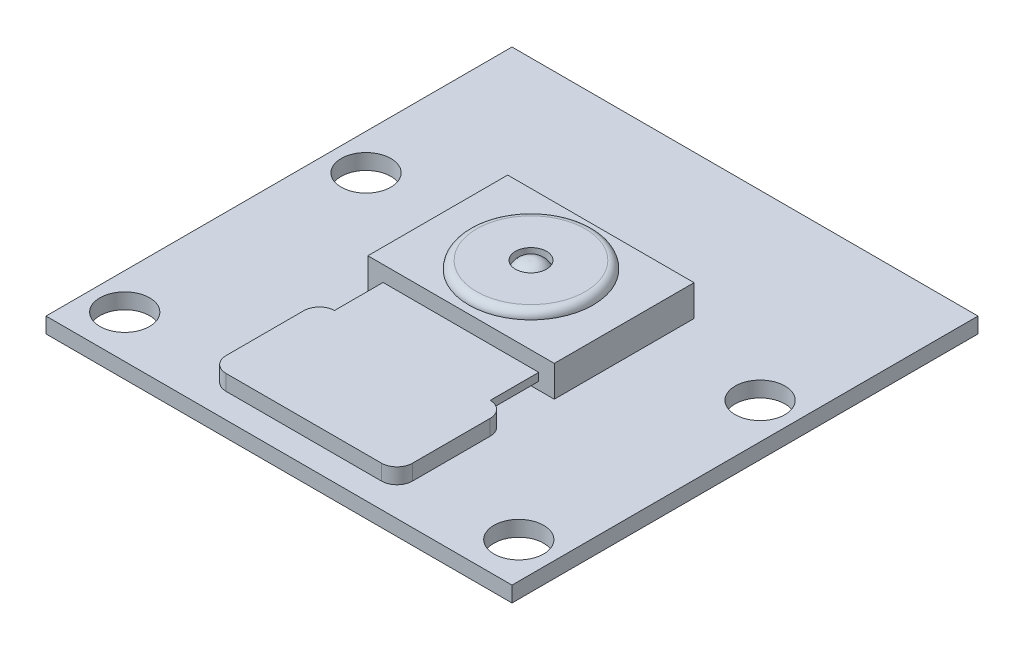
ISO-10303-21;
HEADER;
FILE_DESCRIPTION(('STEP AP214'),'2;1');
FILE_NAME('part.step','',(''),(''),'','','');
FILE_SCHEMA(('AUTOMOTIVE_DESIGN { 1 0 10303 214 1 1 1 1 }'));
ENDSEC;
DATA;
#1=APPLICATION_CONTEXT('core data for automotive mechanical design processes');
#2=APPLICATION_PROTOCOL_DEFINITION('international standard','automotive_design',2000,#1);
#3=PRODUCT_CONTEXT('',#1,'mechanical');
#4=PRODUCT('Part','Part','',(#3));
#5=PRODUCT_RELATED_PRODUCT_CATEGORY('part','',(#4));
#6=PRODUCT_DEFINITION_FORMATION('','',#4);
#7=PRODUCT_DEFINITION_CONTEXT('part definition',#1,'design');
#8=PRODUCT_DEFINITION('design','',#6,#7);
#9=PRODUCT_DEFINITION_SHAPE('','',#8);
#10=(LENGTH_UNIT() NAMED_UNIT(*) SI_UNIT(.MILLI.,.METRE.));
#11=(NAMED_UNIT(*) PLANE_ANGLE_UNIT() SI_UNIT($,.RADIAN.));
#12=(NAMED_UNIT(*) SI_UNIT($,.STERADIAN.) SOLID_ANGLE_UNIT());
#13=UNCERTAINTY_MEASURE_WITH_UNIT(LENGTH_MEASURE(1.E-05),#10,'distance_accuracy_value','');
#14=(GEOMETRIC_REPRESENTATION_CONTEXT(3) GLOBAL_UNCERTAINTY_ASSIGNED_CONTEXT((#13)) GLOBAL_UNIT_ASSIGNED_CONTEXT((#10,
#11,#12)) REPRESENTATION_CONTEXT('',''));
#15=CARTESIAN_POINT('',(0.,0.,0.));
#16=DIRECTION('',(0.,0.,1.));
#17=DIRECTION('',(1.,0.,0.));
#18=AXIS2_PLACEMENT_3D('',#15,#16,#17);
#19=CARTESIAN_POINT('',(0.,3.,-1.22148048115364));
#20=DIRECTION('',(0.,1.,0.));
#21=DIRECTION('',(0.,0.,1.));
#22=AXIS2_PLACEMENT_3D('',#19,#20,#21);
#23=CYLINDRICAL_SURFACE('',#22,1.);
#24=CARTESIAN_POINT('',(0.,3.5,-1.22148048115364));
#25=DIRECTION('',(0.,1.,0.));
#26=DIRECTION('',(0.,0.,1.));
#27=AXIS2_PLACEMENT_3D('',#24,#25,#26);
#28=CIRCLE('',#27,1.);
#29=CARTESIAN_POINT('',(0.,3.5,-0.22148048115364));
#30=VERTEX_POINT('',#29);
#31=EDGE_CURVE('E193',#30,#30,#28,.T.);
#32=ORIENTED_EDGE('',*,*,#31,.T.);
#33=EDGE_LOOP('',(#32));
#34=FACE_BOUND('',#33,.T.);
#35=CARTESIAN_POINT('',(-0.554371974124098,3.00000000000003,-0.389211465566896));
#36=CARTESIAN_POINT('',(-0.544178906791887,3.00006650200129,-0.382421761626189));
#37=CARTESIAN_POINT('',(-0.533861040277246,3.00013092551154,-0.375819406120854));
#38=CARTESIAN_POINT('',(-0.512990772387658,3.00025560987221,-0.362998483615611));
#39=CARTESIAN_POINT('',(-0.502438391617316,3.00031587108642,-0.356779883078594));
#40=CARTESIAN_POINT('',(-0.481113241094692,3.00043223206213,-0.344734862959651));
#41=CARTESIAN_POINT('',(-0.470340489424373,3.00048833216333,-0.338908411367928));
#42=CARTESIAN_POINT('',(-0.448589119870472,3.00059637204323,-0.327655419409491));
#43=CARTESIAN_POINT('',(-0.437610517679698,3.00064831213749,-0.322228848712495));
#44=CARTESIAN_POINT('',(-0.415462218032627,3.00074803305151,-0.311782852182568));
#45=CARTESIAN_POINT('',(-0.40429253402966,3.00079581416265,-0.306763397827846));
#46=CARTESIAN_POINT('',(-0.381777099702852,3.00088721807743,-0.297138314521682));
#47=CARTESIAN_POINT('',(-0.370431360746799,3.00093084114825,-0.292532658980756));
#48=CARTESIAN_POINT('',(-0.347579075743062,3.00101392986784,-0.283741304650766));
#49=CARTESIAN_POINT('',(-0.336072539138216,3.00105339575958,-0.279555581318283));
#50=CARTESIAN_POINT('',(-0.312914130309498,3.00112817092488,-0.271609662206429));
#51=CARTESIAN_POINT('',(-0.301262265769572,3.00116348041718,-0.267849444034258));
#52=CARTESIAN_POINT('',(-0.277828863803228,3.00122994350577,-0.260759539153688));
#53=CARTESIAN_POINT('',(-0.266047332473069,3.00126109729654,-0.257429832297918));
#54=CARTESIAN_POINT('',(-0.242370430405634,3.0013192496224,-0.251205380318952));
#55=CARTESIAN_POINT('',(-0.230475064352731,3.0013462483277,-0.248310617378707));
#56=CARTESIAN_POINT('',(-0.206586476142561,3.00139609104101,-0.242959904161619));
#57=CARTESIAN_POINT('',(-0.194593257437673,3.00141893519495,-0.240503938472795));
#58=CARTESIAN_POINT('',(-0.170525075985715,3.00146046928194,-0.236034086327824));
#59=CARTESIAN_POINT('',(-0.158450115642488,3.00147915933661,-0.234020186929186));
#60=CARTESIAN_POINT('',(-0.134234670492959,3.00151238561936,-0.230437145332013));
#61=CARTESIAN_POINT('',(-0.122094187228451,3.00152692194475,-0.228867992714411));
#62=CARTESIAN_POINT('',(-0.0977640019560296,3.00155184108108,-0.22617653056521));
#63=CARTESIAN_POINT('',(-0.0855743008168355,3.00156222396501,-0.225054213181276));
#64=CARTESIAN_POINT('',(-0.061162050167797,3.00157883644838,-0.223257912596593));
#65=CARTESIAN_POINT('',(-0.0489395010445144,3.00158506609648,-0.222583924142813));
#66=CARTESIAN_POINT('',(-0.0244779678833573,3.0015933722559,-0.221685175793561));
#67=CARTESIAN_POINT('',(-0.0122389839421929,3.00159544879156,-0.221460413266127));
#68=CARTESIAN_POINT('',(0.012238983940139,3.00159544879156,-0.221460413266101));
#69=CARTESIAN_POINT('',(0.0244779678813066,3.0015933722559,-0.221685175793511));
#70=CARTESIAN_POINT('',(0.0489395010424763,3.00158506609647,-0.222583924142712));
#71=CARTESIAN_POINT('',(0.0611620501657684,3.00157883644837,-0.223257912596466));
#72=CARTESIAN_POINT('',(0.0855743008148321,3.001562223965,-0.225054213181101));
#73=CARTESIAN_POINT('',(0.0977640019540418,3.00155184108107,-0.226176530565013));
#74=CARTESIAN_POINT('',(0.122094187226501,3.00152692194474,-0.228867992714168));
#75=CARTESIAN_POINT('',(0.134234670491031,3.00151238561936,-0.230437145331749));
#76=CARTESIAN_POINT('',(0.158450115640609,3.00147915933661,-0.23402018692888));
#77=CARTESIAN_POINT('',(0.170525075983864,3.00146046928194,-0.236034086327499));
#78=CARTESIAN_POINT('',(0.194593257435883,3.00141893519495,-0.240503938472434));
#79=CARTESIAN_POINT('',(0.206586476140804,3.00139609104101,-0.242959904161242));
#80=CARTESIAN_POINT('',(0.230475064351047,3.00134624832769,-0.248310617378302));
#81=CARTESIAN_POINT('',(0.242370430403988,3.00131924962239,-0.251205380318534));
#82=CARTESIAN_POINT('',(0.266047332471506,3.00126109729653,-0.257429832297479));
#83=CARTESIAN_POINT('',(0.27782886380171,3.00122994350576,-0.260759539153242));
#84=CARTESIAN_POINT('',(0.301262265768147,3.00116348041717,-0.2678494440338));
#85=CARTESIAN_POINT('',(0.312914130308122,3.00112817092487,-0.271609662205967));
#86=CARTESIAN_POINT('',(0.336072539136943,3.00105339575956,-0.279555581317819));
#87=CARTESIAN_POINT('',(0.347579075741842,3.00101392986782,-0.283741304650305));
#88=CARTESIAN_POINT('',(0.370431360745691,3.00093084114823,-0.292532658980304));
#89=CARTESIAN_POINT('',(0.381777099701801,3.00088721807741,-0.297138314521238));
#90=CARTESIAN_POINT('',(0.404292534028729,3.00079581416264,-0.306763397827423));
#91=CARTESIAN_POINT('',(0.415462218031757,3.00074803305149,-0.31178285218216));
#92=CARTESIAN_POINT('',(0.437610517678954,3.00064831213747,-0.322228848712122));
#93=CARTESIAN_POINT('',(0.448589119869793,3.00059637204321,-0.327655419409138));
#94=CARTESIAN_POINT('',(0.470340489423826,3.00048833216331,-0.338908411367624));
#95=CARTESIAN_POINT('',(0.481113241094211,3.00043223206211,-0.344734862959375));
#96=CARTESIAN_POINT('',(0.502438391616971,3.00031587108639,-0.356779883078382));
#97=CARTESIAN_POINT('',(0.512990772387384,3.00025560987218,-0.362998483615434));
#98=CARTESIAN_POINT('',(0.533861040277112,3.00013092551152,-0.375819406120757));
#99=CARTESIAN_POINT('',(0.544178906791824,3.00006650200127,-0.382421761626134));
#100=CARTESIAN_POINT('',(0.554371974124104,3.,-0.389211465566888));
#101=B_SPLINE_CURVE_WITH_KNOTS('',3,(#35,#36,#37,#38,#39,#40,#41,#42,#43,#44,#45,#46,#47,#48,
#49,#50,#51,#52,#53,#54,#55,#56,#57,#58,#59,#60,#61,#62,#63,#64,#65,#66,#67,#68,#69,#70,#71,#72,
#73,#74,#75,#76,#77,#78,#79,#80,#81,#82,#83,#84,#85,#86,#87,#88,#89,#90,#91,#92,#93,#94,#95,#96,
#97,#98,#99,#100),.UNSPECIFIED.,.F.,.F.,(4,2,2,2,2,2,2,2,2,2,2,2,2,2,2,2,2,2,2,2,2,2,2,2,2,2,2,
2,2,2,2,2,4),(0.,0.0367406541053907,0.0734780928117864,0.110212529118852,0.146944176307782,
0.183673247921162,0.220399957742831,0.257124519777746,0.293847148231868,0.330568057492038,
0.367287462105868,0.404005576761635,0.440722616268177,0.477438795534791,0.514154329551147,
0.550869433367182,0.587584322073016,0.624299210778857,0.661014314594917,0.697729848611313,
0.734446027877984,0.771163067384598,0.807881182040453,0.844600586654388,0.881321495914679,
0.918044124368938,0.954768686404006,0.991495396225844,1.02822446783941,1.06495611502854,
1.10169055133582,1.13842799004245,1.17516864414809),.UNSPECIFIED.);
#102=CARTESIAN_POINT('',(-0.554371974124105,3.,-0.389211465566887));
#103=VERTEX_POINT('',#102);
#104=CARTESIAN_POINT('',(0.554371974124105,3.,-0.389211465566887));
#105=VERTEX_POINT('',#104);
#106=EDGE_CURVE('E55',#103,#105,#101,.T.);
#107=ORIENTED_EDGE('',*,*,#106,.F.);
#108=CARTESIAN_POINT('',(0.,3.,-1.22148048115364));
#109=DIRECTION('',(0.,1.,0.));
#110=DIRECTION('',(0.,0.,1.));
#111=AXIS2_PLACEMENT_3D('',#108,#109,#110);
#112=CIRCLE('',#111,1.);
#113=EDGE_CURVE('E43',#105,#103,#112,.T.);
#114=ORIENTED_EDGE('',*,*,#113,.F.);
#115=EDGE_LOOP('',(#107,#114));
#116=FACE_BOUND('',#115,.T.);
#117=ADVANCED_FACE('F39',(#34,#116),#23,.F.);
#118=CARTESIAN_POINT('',(0.,3.,-1.22148048115364));
#119=DIRECTION('',(0.,1.,0.));
#120=DIRECTION('',(0.,0.,1.));
#121=AXIS2_PLACEMENT_3D('',#118,#119,#120);
#122=PLANE('',#121);
#123=ORIENTED_EDGE('',*,*,#113,.T.);
#124=CARTESIAN_POINT('',(0.,3.,-1.21704200870454));
#125=DIRECTION('',(0.,1.,0.));
#126=DIRECTION('',(0.,0.,1.));
#127=AXIS2_PLACEMENT_3D('',#124,#125,#126);
#128=CIRCLE('',#127,0.996309035312757);
#129=EDGE_CURVE('E11',#103,#105,#128,.F.);
#130=ORIENTED_EDGE('',*,*,#129,.T.);
#131=EDGE_LOOP('',(#123,#130));
#132=FACE_BOUND('',#131,.T.);
#133=ADVANCED_FACE('F196',(#132),#122,.T.);
#134=CARTESIAN_POINT('',(0.,3.,0.));
#135=DIRECTION('',(0.,-1.,0.));
#136=DIRECTION('',(0.,0.,-1.));
#137=AXIS2_PLACEMENT_3D('',#134,#135,#136);
#138=PLANE('',#137);
#139=DIRECTION('',(0.,0.,-1.));
#140=VECTOR('',#139,1.);
#141=CARTESIAN_POINT('',(6.,3.,3.27851951884636));
#142=LINE('',#141,#140);
#143=CARTESIAN_POINT('',(6.,3.,3.27851951884636));
#144=VERTEX_POINT('',#143);
#145=CARTESIAN_POINT('',(6.,3.,-5.72148048115364));
#146=VERTEX_POINT('',#145);
#147=EDGE_CURVE('E223',#144,#146,#142,.T.);
#148=ORIENTED_EDGE('',*,*,#147,.T.);
#149=DIRECTION('',(-1.,0.,0.));
#150=VECTOR('',#149,1.);
#151=CARTESIAN_POINT('',(-6.,3.,-5.72148048115364));
#152=LINE('',#151,#150);
#153=CARTESIAN_POINT('',(-6.,3.,-5.72148048115364));
#154=VERTEX_POINT('',#153);
#155=EDGE_CURVE('E226',#146,#154,#152,.T.);
#156=ORIENTED_EDGE('',*,*,#155,.T.);
#157=DIRECTION('',(0.,0.,1.));
#158=VECTOR('',#157,1.);
#159=CARTESIAN_POINT('',(-6.,3.,3.27851951884636));
#160=LINE('',#159,#158);
#161=CARTESIAN_POINT('',(-6.,3.,3.27851951884636));
#162=VERTEX_POINT('',#161);
#163=EDGE_CURVE('E229',#154,#162,#160,.T.);
#164=ORIENTED_EDGE('',*,*,#163,.T.);
#165=DIRECTION('',(1.,0.,0.));
#166=VECTOR('',#165,1.);
#167=CARTESIAN_POINT('',(-6.,3.,3.27851951884636));
#168=LINE('',#167,#166);
#169=EDGE_CURVE('E231',#162,#144,#168,.T.);
#170=ORIENTED_EDGE('',*,*,#169,.T.);
#171=EDGE_LOOP('',(#148,#156,#164,#170));
#172=FACE_BOUND('',#171,.T.);
#173=CARTESIAN_POINT('',(0.,3.,-1.22148048115364));
#174=DIRECTION('',(0.,-1.,0.));
#175=DIRECTION('',(0.,0.,-1.));
#176=AXIS2_PLACEMENT_3D('',#173,#174,#175);
#177=CIRCLE('',#176,4.);
#178=CARTESIAN_POINT('',(0.,3.,-5.22148048115364));
#179=VERTEX_POINT('',#178);
#180=EDGE_CURVE('E384',#179,#179,#177,.F.);
#181=ORIENTED_EDGE('',*,*,#180,.F.);
#182=EDGE_LOOP('',(#181));
#183=FACE_BOUND('',#182,.T.);
#184=ADVANCED_FACE('F404',(#172,#183),#138,.F.);
#185=CARTESIAN_POINT('',(-4.99999999999999,2.,6.40352104947633));
#186=DIRECTION('',(0.,0.,1.));
#187=DIRECTION('',(1.,0.,0.));
#188=AXIS2_PLACEMENT_3D('',#185,#186,#187);
#189=PLANE('',#188);
#190=DIRECTION('',(-1.,0.,0.));
#191=VECTOR('',#190,1.);
#192=CARTESIAN_POINT('',(4.99999999999999,1.5,6.40352104947633));
#193=LINE('',#192,#191);
#194=CARTESIAN_POINT('',(4.99999999999999,1.5,6.40352104947633));
#195=VERTEX_POINT('',#194);
#196=CARTESIAN_POINT('',(-5.,1.5,6.40352104947633));
#197=VERTEX_POINT('',#196);
#198=EDGE_CURVE('E207',#195,#197,#193,.T.);
#199=ORIENTED_EDGE('',*,*,#198,.F.);
#200=DIRECTION('',(0.,-1.,0.));
#201=VECTOR('',#200,1.);
#202=CARTESIAN_POINT('',(4.99999999999999,2.,6.40352104947633));
#203=LINE('',#202,#201);
#204=CARTESIAN_POINT('',(4.99999999999999,1.,6.40352104947633));
#205=VERTEX_POINT('',#204);
#206=EDGE_CURVE('E311',#195,#205,#203,.T.);
#207=ORIENTED_EDGE('',*,*,#206,.T.);
#208=DIRECTION('',(-1.,0.,0.));
#209=VECTOR('',#208,1.);
#210=CARTESIAN_POINT('',(-4.99999999999999,1.,6.40352104947633));
#211=LINE('',#210,#209);
#212=CARTESIAN_POINT('',(-5.,1.,6.40352104947633));
#213=VERTEX_POINT('',#212);
#214=EDGE_CURVE('E282',#205,#213,#211,.T.);
#215=ORIENTED_EDGE('',*,*,#214,.T.);
#216=DIRECTION('',(0.,-1.,0.));
#217=VECTOR('',#216,1.);
#218=CARTESIAN_POINT('',(-4.99999999999999,2.,6.40352104947633));
#219=LINE('',#218,#217);
#220=EDGE_CURVE('E307',#197,#213,#219,.T.);
#221=ORIENTED_EDGE('',*,*,#220,.F.);
#222=EDGE_LOOP('',(#199,#207,#215,#221));
#223=FACE_BOUND('',#222,.T.);
#224=ADVANCED_FACE('F443',(#223),#189,.F.);
#225=CARTESIAN_POINT('',(-6.,3.,3.27851951884636));
#226=DIRECTION('',(0.,0.,-1.));
#227=DIRECTION('',(-1.,0.,0.));
#228=AXIS2_PLACEMENT_3D('',#225,#226,#227);
#229=PLANE('',#228);
#230=DIRECTION('',(1.,0.,0.));
#231=VECTOR('',#230,1.);
#232=CARTESIAN_POINT('',(-6.,1.,3.27851951884636));
#233=LINE('',#232,#231);
#234=CARTESIAN_POINT('',(-6.,1.,3.27851951884636));
#235=VERTEX_POINT('',#234);
#236=CARTESIAN_POINT('',(6.,1.,3.27851951884636));
#237=VERTEX_POINT('',#236);
#238=EDGE_CURVE('E227',#235,#237,#233,.T.);
#239=ORIENTED_EDGE('',*,*,#238,.T.);
#240=DIRECTION('',(0.,-1.,0.));
#241=VECTOR('',#240,1.);
#242=CARTESIAN_POINT('',(6.,3.,3.27851951884636));
#243=LINE('',#242,#241);
#244=EDGE_CURVE('E233',#144,#237,#243,.T.);
#245=ORIENTED_EDGE('',*,*,#244,.F.);
#246=ORIENTED_EDGE('',*,*,#169,.F.);
#247=DIRECTION('',(0.,-1.,0.));
#248=VECTOR('',#247,1.);
#249=CARTESIAN_POINT('',(-6.,3.,3.27851951884636));
#250=LINE('',#249,#248);
#251=EDGE_CURVE('E246',#162,#235,#250,.T.);
#252=ORIENTED_EDGE('',*,*,#251,.T.);
#253=EDGE_LOOP('',(#239,#245,#246,#252));
#254=FACE_BOUND('',#253,.T.);
#255=DIRECTION('',(-1.,0.,0.));
#256=VECTOR('',#255,1.);
#257=CARTESIAN_POINT('',(-6.,2.,3.27851951884636));
#258=LINE('',#257,#256);
#259=CARTESIAN_POINT('',(4.99999999999999,2.,3.27851951884636));
#260=VERTEX_POINT('',#259);
#261=CARTESIAN_POINT('',(-5.02237147679807,2.,3.27851951884636));
#262=VERTEX_POINT('',#261);
#263=EDGE_CURVE('E63',#260,#262,#258,.T.);
#264=ORIENTED_EDGE('',*,*,#263,.F.);
#265=DIRECTION('',(0.,1.,0.));
#266=VECTOR('',#265,1.);
#267=CARTESIAN_POINT('',(4.99999999999999,3.,3.27851951884636));
#268=LINE('',#267,#266);
#269=CARTESIAN_POINT('',(4.99999999999999,1.5,3.27851951884636));
#270=VERTEX_POINT('',#269);
#271=EDGE_CURVE('E381',#270,#260,#268,.T.);
#272=ORIENTED_EDGE('',*,*,#271,.F.);
#273=DIRECTION('',(1.,0.,0.));
#274=VECTOR('',#273,1.);
#275=CARTESIAN_POINT('',(-6.,1.5,3.27851951884636));
#276=LINE('',#275,#274);
#277=CARTESIAN_POINT('',(-5.02237147679807,1.5,3.27851951884636));
#278=VERTEX_POINT('',#277);
#279=EDGE_CURVE('E378',#278,#270,#276,.T.);
#280=ORIENTED_EDGE('',*,*,#279,.F.);
#281=DIRECTION('',(0.,-1.,0.));
#282=VECTOR('',#281,1.);
#283=CARTESIAN_POINT('',(-5.02237147679807,3.,3.27851951884636));
#284=LINE('',#283,#282);
#285=EDGE_CURVE('E375',#262,#278,#284,.T.);
#286=ORIENTED_EDGE('',*,*,#285,.F.);
#287=EDGE_LOOP('',(#264,#272,#280,#286));
#288=FACE_BOUND('',#287,.T.);
#289=ADVANCED_FACE('F445',(#254,#288),#229,.F.);
#290=CARTESIAN_POINT('',(0.,1.,0.));
#291=DIRECTION('',(0.,-1.,0.));
#292=DIRECTION('',(0.,0.,-1.));
#293=AXIS2_PLACEMENT_3D('',#290,#291,#292);
#294=PLANE('',#293);
#295=CARTESIAN_POINT('',(5.,1.,12.4035210494763));
#296=DIRECTION('',(0.,1.,0.));
#297=DIRECTION('',(0.,0.,1.));
#298=AXIS2_PLACEMENT_3D('',#295,#296,#297);
#299=CIRCLE('',#298,1.);
#300=CARTESIAN_POINT('',(4.99999999999999,1.,13.4035210494763));
#301=VERTEX_POINT('',#300);
#302=CARTESIAN_POINT('',(6.,1.,12.4035210494763));
#303=VERTEX_POINT('',#302);
#304=EDGE_CURVE('E255',#301,#303,#299,.T.);
#305=ORIENTED_EDGE('',*,*,#304,.F.);
#306=DIRECTION('',(1.,0.,0.));
#307=VECTOR('',#306,1.);
#308=CARTESIAN_POINT('',(-4.99999999999999,1.,13.4035210494763));
#309=LINE('',#308,#307);
#310=CARTESIAN_POINT('',(-4.99999999999999,1.,13.4035210494763));
#311=VERTEX_POINT('',#310);
#312=EDGE_CURVE('E260',#311,#301,#309,.T.);
#313=ORIENTED_EDGE('',*,*,#312,.F.);
#314=CARTESIAN_POINT('',(-5.,1.,12.4035210494763));
#315=DIRECTION('',(0.,1.,0.));
#316=DIRECTION('',(0.,0.,-1.));
#317=AXIS2_PLACEMENT_3D('',#314,#315,#316);
#318=CIRCLE('',#317,1.);
#319=CARTESIAN_POINT('',(-6.,1.,12.4035210494763));
#320=VERTEX_POINT('',#319);
#321=EDGE_CURVE('E291',#320,#311,#318,.T.);
#322=ORIENTED_EDGE('',*,*,#321,.F.);
#323=DIRECTION('',(0.,0.,1.));
#324=VECTOR('',#323,1.);
#325=CARTESIAN_POINT('',(-6.,1.,12.4035210494763));
#326=LINE('',#325,#324);
#327=CARTESIAN_POINT('',(-6.,1.,7.40352104947634));
#328=VERTEX_POINT('',#327);
#329=EDGE_CURVE('E288',#328,#320,#326,.T.);
#330=ORIENTED_EDGE('',*,*,#329,.F.);
#331=CARTESIAN_POINT('',(-5.,1.,7.40352104947633));
#332=DIRECTION('',(0.,1.,0.));
#333=DIRECTION('',(0.,0.,-1.));
#334=AXIS2_PLACEMENT_3D('',#331,#332,#333);
#335=CIRCLE('',#334,1.);
#336=EDGE_CURVE('E285',#213,#328,#335,.T.);
#337=ORIENTED_EDGE('',*,*,#336,.F.);
#338=ORIENTED_EDGE('',*,*,#214,.F.);
#339=CARTESIAN_POINT('',(5.,1.,7.40352104947633));
#340=DIRECTION('',(0.,1.,0.));
#341=DIRECTION('',(0.,0.,-1.));
#342=AXIS2_PLACEMENT_3D('',#339,#340,#341);
#343=CIRCLE('',#342,1.);
#344=CARTESIAN_POINT('',(6.,1.,7.40352104947634));
#345=VERTEX_POINT('',#344);
#346=EDGE_CURVE('E279',#345,#205,#343,.T.);
#347=ORIENTED_EDGE('',*,*,#346,.F.);
#348=DIRECTION('',(0.,0.,-1.));
#349=VECTOR('',#348,1.);
#350=CARTESIAN_POINT('',(6.,1.,12.4035210494763));
#351=LINE('',#350,#349);
#352=EDGE_CURVE('E276',#303,#345,#351,.T.);
#353=ORIENTED_EDGE('',*,*,#352,.F.);
#354=EDGE_LOOP('',(#305,#313,#322,#330,#337,#338,#347,#353));
#355=FACE_BOUND('',#354,.T.);
#356=CARTESIAN_POINT('',(12.6844125223959,1.,12.2471142963956));
#357=DIRECTION('',(0.,1.,0.));
#358=DIRECTION('',(0.,0.,-1.));
#359=AXIS2_PLACEMENT_3D('',#356,#357,#358);
#360=CIRCLE('',#359,1.6);
#361=CARTESIAN_POINT('',(12.6844125223959,1.,10.6471142963956));
#362=VERTEX_POINT('',#361);
#363=EDGE_CURVE('E328',#362,#362,#360,.T.);
#364=ORIENTED_EDGE('',*,*,#363,.F.);
#365=EDGE_LOOP('',(#364));
#366=FACE_BOUND('',#365,.T.);
#367=CARTESIAN_POINT('',(-12.6844125223959,1.,-3.28614209302994));
#368=DIRECTION('',(0.,1.,0.));
#369=DIRECTION('',(0.,0.,1.));
#370=AXIS2_PLACEMENT_3D('',#367,#368,#369);
#371=CIRCLE('',#370,1.6);
#372=CARTESIAN_POINT('',(-12.6844125223959,1.,-1.68614209302994));
#373=VERTEX_POINT('',#372);
#374=EDGE_CURVE('E340',#373,#373,#371,.T.);
#375=ORIENTED_EDGE('',*,*,#374,.F.);
#376=EDGE_LOOP('',(#375));
#377=FACE_BOUND('',#376,.T.);
#378=DIRECTION('',(0.,0.,-1.));
#379=VECTOR('',#378,1.);
#380=CARTESIAN_POINT('',(15.,1.,15.));
#381=LINE('',#380,#379);
#382=CARTESIAN_POINT('',(15.,1.,15.));
#383=VERTEX_POINT('',#382);
#384=CARTESIAN_POINT('',(15.,1.,-15.));
#385=VERTEX_POINT('',#384);
#386=EDGE_CURVE('E346',#383,#385,#381,.T.);
#387=ORIENTED_EDGE('',*,*,#386,.T.);
#388=DIRECTION('',(-1.,0.,0.));
#389=VECTOR('',#388,1.);
#390=CARTESIAN_POINT('',(-15.,1.,-15.));
#391=LINE('',#390,#389);
#392=CARTESIAN_POINT('',(-15.,1.,-15.));
#393=VERTEX_POINT('',#392);
#394=EDGE_CURVE('E349',#385,#393,#391,.T.);
#395=ORIENTED_EDGE('',*,*,#394,.T.);
#396=DIRECTION('',(0.,0.,1.));
#397=VECTOR('',#396,1.);
#398=CARTESIAN_POINT('',(-15.,1.,15.));
#399=LINE('',#398,#397);
#400=CARTESIAN_POINT('',(-15.,1.,15.));
#401=VERTEX_POINT('',#400);
#402=EDGE_CURVE('E352',#393,#401,#399,.T.);
#403=ORIENTED_EDGE('',*,*,#402,.T.);
#404=DIRECTION('',(1.,0.,0.));
#405=VECTOR('',#404,1.);
#406=CARTESIAN_POINT('',(-15.,1.,15.));
#407=LINE('',#406,#405);
#408=EDGE_CURVE('E354',#401,#383,#407,.T.);
#409=ORIENTED_EDGE('',*,*,#408,.T.);
#410=EDGE_LOOP('',(#387,#395,#403,#409));
#411=FACE_BOUND('',#410,.T.);
#412=CARTESIAN_POINT('',(-12.6844125223959,1.,12.2471142963956));
#413=DIRECTION('',(0.,1.,0.));
#414=DIRECTION('',(0.,0.,1.));
#415=AXIS2_PLACEMENT_3D('',#412,#413,#414);
#416=CIRCLE('',#415,1.6);
#417=CARTESIAN_POINT('',(-12.6844125223959,1.,13.8471142963956));
#418=VERTEX_POINT('',#417);
#419=EDGE_CURVE('E334',#418,#418,#416,.T.);
#420=ORIENTED_EDGE('',*,*,#419,.F.);
#421=EDGE_LOOP('',(#420));
#422=FACE_BOUND('',#421,.T.);
#423=CARTESIAN_POINT('',(12.6844125223959,1.,-3.28614209302994));
#424=DIRECTION('',(0.,1.,0.));
#425=DIRECTION('',(0.,0.,-1.));
#426=AXIS2_PLACEMENT_3D('',#423,#424,#425);
#427=CIRCLE('',#426,1.6);
#428=CARTESIAN_POINT('',(12.6844125223959,1.,-4.88614209302994));
#429=VERTEX_POINT('',#428);
#430=EDGE_CURVE('E322',#429,#429,#427,.T.);
#431=ORIENTED_EDGE('',*,*,#430,.F.);
#432=EDGE_LOOP('',(#431));
#433=FACE_BOUND('',#432,.T.);
#434=DIRECTION('',(0.,0.,-1.));
#435=VECTOR('',#434,1.);
#436=CARTESIAN_POINT('',(6.,1.,3.27851951884636));
#437=LINE('',#436,#435);
#438=CARTESIAN_POINT('',(6.,1.,-5.72148048115364));
#439=VERTEX_POINT('',#438);
#440=EDGE_CURVE('E222',#237,#439,#437,.T.);
#441=ORIENTED_EDGE('',*,*,#440,.F.);
#442=ORIENTED_EDGE('',*,*,#238,.F.);
#443=DIRECTION('',(0.,0.,1.));
#444=VECTOR('',#443,1.);
#445=CARTESIAN_POINT('',(-6.,1.,3.27851951884636));
#446=LINE('',#445,#444);
#447=CARTESIAN_POINT('',(-6.,1.,-5.72148048115364));
#448=VERTEX_POINT('',#447);
#449=EDGE_CURVE('E239',#448,#235,#446,.T.);
#450=ORIENTED_EDGE('',*,*,#449,.F.);
#451=DIRECTION('',(-1.,0.,0.));
#452=VECTOR('',#451,1.);
#453=CARTESIAN_POINT('',(-6.,1.,-5.72148048115364));
#454=LINE('',#453,#452);
#455=EDGE_CURVE('E236',#439,#448,#454,.T.);
#456=ORIENTED_EDGE('',*,*,#455,.F.);
#457=EDGE_LOOP('',(#441,#442,#450,#456));
#458=FACE_BOUND('',#457,.T.);
#459=ADVANCED_FACE('F448',(#355,#366,#377,#411,#422,#433,#458),#294,.F.);
#460=CARTESIAN_POINT('',(0.,0.,0.));
#461=DIRECTION('',(0.,-1.,0.));
#462=DIRECTION('',(0.,0.,-1.));
#463=AXIS2_PLACEMENT_3D('',#460,#461,#462);
#464=PLANE('',#463);
#465=CARTESIAN_POINT('',(12.6844125223959,0.,12.2471142963956));
#466=DIRECTION('',(0.,1.,0.));
#467=DIRECTION('',(0.,0.,-1.));
#468=AXIS2_PLACEMENT_3D('',#465,#466,#467);
#469=CIRCLE('',#468,1.6);
#470=CARTESIAN_POINT('',(12.6844125223959,0.,10.6471142963956));
#471=VERTEX_POINT('',#470);
#472=EDGE_CURVE('E325',#471,#471,#469,.T.);
#473=ORIENTED_EDGE('',*,*,#472,.T.);
#474=EDGE_LOOP('',(#473));
#475=FACE_BOUND('',#474,.T.);
#476=CARTESIAN_POINT('',(-12.6844125223959,0.,-3.28614209302994));
#477=DIRECTION('',(0.,1.,0.));
#478=DIRECTION('',(0.,0.,1.));
#479=AXIS2_PLACEMENT_3D('',#476,#477,#478);
#480=CIRCLE('',#479,1.6);
#481=CARTESIAN_POINT('',(-12.6844125223959,0.,-1.68614209302994));
#482=VERTEX_POINT('',#481);
#483=EDGE_CURVE('E337',#482,#482,#480,.T.);
#484=ORIENTED_EDGE('',*,*,#483,.T.);
#485=EDGE_LOOP('',(#484));
#486=FACE_BOUND('',#485,.T.);
#487=DIRECTION('',(0.,0.,-1.));
#488=VECTOR('',#487,1.);
#489=CARTESIAN_POINT('',(15.,0.,15.));
#490=LINE('',#489,#488);
#491=CARTESIAN_POINT('',(15.,0.,15.));
#492=VERTEX_POINT('',#491);
#493=CARTESIAN_POINT('',(15.,0.,-15.));
#494=VERTEX_POINT('',#493);
#495=EDGE_CURVE('E343',#492,#494,#490,.T.);
#496=ORIENTED_EDGE('',*,*,#495,.F.);
#497=DIRECTION('',(1.,0.,0.));
#498=VECTOR('',#497,1.);
#499=CARTESIAN_POINT('',(-15.,0.,15.));
#500=LINE('',#499,#498);
#501=CARTESIAN_POINT('',(-15.,0.,15.));
#502=VERTEX_POINT('',#501);
#503=EDGE_CURVE('E350',#502,#492,#500,.T.);
#504=ORIENTED_EDGE('',*,*,#503,.F.);
#505=DIRECTION('',(0.,0.,1.));
#506=VECTOR('',#505,1.);
#507=CARTESIAN_POINT('',(-15.,0.,15.));
#508=LINE('',#507,#506);
#509=CARTESIAN_POINT('',(-15.,0.,-15.));
#510=VERTEX_POINT('',#509);
#511=EDGE_CURVE('E361',#510,#502,#508,.T.);
#512=ORIENTED_EDGE('',*,*,#511,.F.);
#513=DIRECTION('',(-1.,0.,0.));
#514=VECTOR('',#513,1.);
#515=CARTESIAN_POINT('',(-15.,0.,-15.));
#516=LINE('',#515,#514);
#517=EDGE_CURVE('E359',#494,#510,#516,.T.);
#518=ORIENTED_EDGE('',*,*,#517,.F.);
#519=EDGE_LOOP('',(#496,#504,#512,#518));
#520=FACE_BOUND('',#519,.T.);
#521=CARTESIAN_POINT('',(-12.6844125223959,0.,12.2471142963956));
#522=DIRECTION('',(0.,1.,0.));
#523=DIRECTION('',(0.,0.,1.));
#524=AXIS2_PLACEMENT_3D('',#521,#522,#523);
#525=CIRCLE('',#524,1.6);
#526=CARTESIAN_POINT('',(-12.6844125223959,0.,13.8471142963956));
#527=VERTEX_POINT('',#526);
#528=EDGE_CURVE('E331',#527,#527,#525,.T.);
#529=ORIENTED_EDGE('',*,*,#528,.T.);
#530=EDGE_LOOP('',(#529));
#531=FACE_BOUND('',#530,.T.);
#532=CARTESIAN_POINT('',(12.6844125223959,0.,-3.28614209302994));
#533=DIRECTION('',(0.,1.,0.));
#534=DIRECTION('',(0.,0.,-1.));
#535=AXIS2_PLACEMENT_3D('',#532,#533,#534);
#536=CIRCLE('',#535,1.6);
#537=CARTESIAN_POINT('',(12.6844125223959,0.,-4.88614209302994));
#538=VERTEX_POINT('',#537);
#539=EDGE_CURVE('E321',#538,#538,#536,.T.);
#540=ORIENTED_EDGE('',*,*,#539,.T.);
#541=EDGE_LOOP('',(#540));
#542=FACE_BOUND('',#541,.T.);
#543=ADVANCED_FACE('F515',(#475,#486,#520,#531,#542),#464,.T.);
#544=CARTESIAN_POINT('',(15.,1.,15.));
#545=DIRECTION('',(-1.,0.,0.));
#546=DIRECTION('',(0.,0.,1.));
#547=AXIS2_PLACEMENT_3D('',#544,#545,#546);
#548=PLANE('',#547);
#549=ORIENTED_EDGE('',*,*,#495,.T.);
#550=DIRECTION('',(0.,-1.,0.));
#551=VECTOR('',#550,1.);
#552=CARTESIAN_POINT('',(15.,1.,-15.));
#553=LINE('',#552,#551);
#554=EDGE_CURVE('E372',#385,#494,#553,.T.);
#555=ORIENTED_EDGE('',*,*,#554,.F.);
#556=ORIENTED_EDGE('',*,*,#386,.F.);
#557=DIRECTION('',(0.,-1.,0.));
#558=VECTOR('',#557,1.);
#559=CARTESIAN_POINT('',(15.,1.,15.));
#560=LINE('',#559,#558);
#561=EDGE_CURVE('E356',#383,#492,#560,.T.);
#562=ORIENTED_EDGE('',*,*,#561,.T.);
#563=EDGE_LOOP('',(#549,#555,#556,#562));
#564=FACE_BOUND('',#563,.T.);
#565=ADVANCED_FACE('F519',(#564),#548,.F.);
#566=CARTESIAN_POINT('',(-15.,1.,-15.));
#567=DIRECTION('',(0.,0.,1.));
#568=DIRECTION('',(1.,0.,0.));
#569=AXIS2_PLACEMENT_3D('',#566,#567,#568);
#570=PLANE('',#569);
#571=ORIENTED_EDGE('',*,*,#517,.T.);
#572=DIRECTION('',(0.,-1.,0.));
#573=VECTOR('',#572,1.);
#574=CARTESIAN_POINT('',(-15.,1.,-15.));
#575=LINE('',#574,#573);
#576=EDGE_CURVE('E369',#393,#510,#575,.T.);
#577=ORIENTED_EDGE('',*,*,#576,.F.);
#578=ORIENTED_EDGE('',*,*,#394,.F.);
#579=ORIENTED_EDGE('',*,*,#554,.T.);
#580=EDGE_LOOP('',(#571,#577,#578,#579));
#581=FACE_BOUND('',#580,.T.);
#582=ADVANCED_FACE('F527',(#581),#570,.F.);
#583=CARTESIAN_POINT('',(-15.,1.,15.));
#584=DIRECTION('',(1.,0.,0.));
#585=DIRECTION('',(0.,0.,-1.));
#586=AXIS2_PLACEMENT_3D('',#583,#584,#585);
#587=PLANE('',#586);
#588=ORIENTED_EDGE('',*,*,#511,.T.);
#589=DIRECTION('',(0.,-1.,0.));
#590=VECTOR('',#589,1.);
#591=CARTESIAN_POINT('',(-15.,1.,15.));
#592=LINE('',#591,#590);
#593=EDGE_CURVE('E366',#401,#502,#592,.T.);
#594=ORIENTED_EDGE('',*,*,#593,.F.);
#595=ORIENTED_EDGE('',*,*,#402,.F.);
#596=ORIENTED_EDGE('',*,*,#576,.T.);
#597=EDGE_LOOP('',(#588,#594,#595,#596));
#598=FACE_BOUND('',#597,.T.);
#599=ADVANCED_FACE('F523',(#598),#587,.F.);
#600=CARTESIAN_POINT('',(-15.,1.,15.));
#601=DIRECTION('',(0.,0.,-1.));
#602=DIRECTION('',(-1.,0.,0.));
#603=AXIS2_PLACEMENT_3D('',#600,#601,#602);
#604=PLANE('',#603);
#605=ORIENTED_EDGE('',*,*,#503,.T.);
#606=ORIENTED_EDGE('',*,*,#561,.F.);
#607=ORIENTED_EDGE('',*,*,#408,.F.);
#608=ORIENTED_EDGE('',*,*,#593,.T.);
#609=EDGE_LOOP('',(#605,#606,#607,#608));
#610=FACE_BOUND('',#609,.T.);
#611=ADVANCED_FACE('F511',(#610),#604,.F.);
#612=CARTESIAN_POINT('',(-12.6844125223959,1.,-3.28614209302994));
#613=DIRECTION('',(0.,-1.,0.));
#614=DIRECTION('',(0.,0.,-1.));
#615=AXIS2_PLACEMENT_3D('',#612,#613,#614);
#616=CYLINDRICAL_SURFACE('',#615,1.6);
#617=ORIENTED_EDGE('',*,*,#374,.T.);
#618=EDGE_LOOP('',(#617));
#619=FACE_BOUND('',#618,.T.);
#620=ORIENTED_EDGE('',*,*,#483,.F.);
#621=EDGE_LOOP('',(#620));
#622=FACE_BOUND('',#621,.T.);
#623=ADVANCED_FACE('F507',(#619,#622),#616,.F.);
#624=CARTESIAN_POINT('',(-12.6844125223959,1.,12.2471142963956));
#625=DIRECTION('',(0.,-1.,0.));
#626=DIRECTION('',(0.,0.,-1.));
#627=AXIS2_PLACEMENT_3D('',#624,#625,#626);
#628=CYLINDRICAL_SURFACE('',#627,1.6);
#629=ORIENTED_EDGE('',*,*,#419,.T.);
#630=EDGE_LOOP('',(#629));
#631=FACE_BOUND('',#630,.T.);
#632=ORIENTED_EDGE('',*,*,#528,.F.);
#633=EDGE_LOOP('',(#632));
#634=FACE_BOUND('',#633,.T.);
#635=ADVANCED_FACE('F503',(#631,#634),#628,.F.);
#636=CARTESIAN_POINT('',(12.6844125223959,1.,12.2471142963956));
#637=DIRECTION('',(0.,-1.,0.));
#638=DIRECTION('',(0.,0.,-1.));
#639=AXIS2_PLACEMENT_3D('',#636,#637,#638);
#640=CYLINDRICAL_SURFACE('',#639,1.6);
#641=ORIENTED_EDGE('',*,*,#363,.T.);
#642=EDGE_LOOP('',(#641));
#643=FACE_BOUND('',#642,.T.);
#644=ORIENTED_EDGE('',*,*,#472,.F.);
#645=EDGE_LOOP('',(#644));
#646=FACE_BOUND('',#645,.T.);
#647=ADVANCED_FACE('F499',(#643,#646),#640,.F.);
#648=CARTESIAN_POINT('',(12.6844125223959,1.,-3.28614209302994));
#649=DIRECTION('',(0.,-1.,0.));
#650=DIRECTION('',(0.,0.,-1.));
#651=AXIS2_PLACEMENT_3D('',#648,#649,#650);
#652=CYLINDRICAL_SURFACE('',#651,1.6);
#653=ORIENTED_EDGE('',*,*,#430,.T.);
#654=EDGE_LOOP('',(#653));
#655=FACE_BOUND('',#654,.T.);
#656=ORIENTED_EDGE('',*,*,#539,.F.);
#657=EDGE_LOOP('',(#656));
#658=FACE_BOUND('',#657,.T.);
#659=ADVANCED_FACE('F495',(#655,#658),#652,.F.);
#660=CARTESIAN_POINT('',(5.,2.,12.4035210494763));
#661=DIRECTION('',(0.,-1.,0.));
#662=DIRECTION('',(0.,0.,-1.));
#663=AXIS2_PLACEMENT_3D('',#660,#661,#662);
#664=CYLINDRICAL_SURFACE('',#663,1.);
#665=ORIENTED_EDGE('',*,*,#304,.T.);
#666=DIRECTION('',(0.,-1.,0.));
#667=VECTOR('',#666,1.);
#668=CARTESIAN_POINT('',(6.,2.,12.4035210494763));
#669=LINE('',#668,#667);
#670=CARTESIAN_POINT('',(6.,2.,12.4035210494763));
#671=VERTEX_POINT('',#670);
#672=EDGE_CURVE('E318',#671,#303,#669,.T.);
#673=ORIENTED_EDGE('',*,*,#672,.F.);
#674=CARTESIAN_POINT('',(5.,2.,12.4035210494763));
#675=DIRECTION('',(0.,1.,0.));
#676=DIRECTION('',(0.,0.,1.));
#677=AXIS2_PLACEMENT_3D('',#674,#675,#676);
#678=CIRCLE('',#677,1.);
#679=CARTESIAN_POINT('',(4.99999999999999,2.,13.4035210494763));
#680=VERTEX_POINT('',#679);
#681=EDGE_CURVE('E256',#680,#671,#678,.T.);
#682=ORIENTED_EDGE('',*,*,#681,.F.);
#683=DIRECTION('',(0.,-1.,0.));
#684=VECTOR('',#683,1.);
#685=CARTESIAN_POINT('',(4.99999999999999,2.,13.4035210494763));
#686=LINE('',#685,#684);
#687=EDGE_CURVE('E273',#680,#301,#686,.T.);
#688=ORIENTED_EDGE('',*,*,#687,.T.);
#689=EDGE_LOOP('',(#665,#673,#682,#688));
#690=FACE_BOUND('',#689,.T.);
#691=ADVANCED_FACE('F491',(#690),#664,.T.);
#692=CARTESIAN_POINT('',(6.,2.,12.4035210494763));
#693=DIRECTION('',(-1.,0.,0.));
#694=DIRECTION('',(0.,0.,1.));
#695=AXIS2_PLACEMENT_3D('',#692,#693,#694);
#696=PLANE('',#695);
#697=ORIENTED_EDGE('',*,*,#352,.T.);
#698=DIRECTION('',(0.,-1.,0.));
#699=VECTOR('',#698,1.);
#700=CARTESIAN_POINT('',(6.,2.,7.40352104947634));
#701=LINE('',#700,#699);
#702=CARTESIAN_POINT('',(6.,2.,7.40352104947634));
#703=VERTEX_POINT('',#702);
#704=EDGE_CURVE('E315',#703,#345,#701,.T.);
#705=ORIENTED_EDGE('',*,*,#704,.F.);
#706=DIRECTION('',(0.,0.,-1.));
#707=VECTOR('',#706,1.);
#708=CARTESIAN_POINT('',(6.,2.,12.4035210494763));
#709=LINE('',#708,#707);
#710=EDGE_CURVE('E259',#671,#703,#709,.T.);
#711=ORIENTED_EDGE('',*,*,#710,.F.);
#712=ORIENTED_EDGE('',*,*,#672,.T.);
#713=EDGE_LOOP('',(#697,#705,#711,#712));
#714=FACE_BOUND('',#713,.T.);
#715=ADVANCED_FACE('F487',(#714),#696,.F.);
#716=CARTESIAN_POINT('',(5.,2.,7.40352104947633));
#717=DIRECTION('',(0.,-1.,0.));
#718=DIRECTION('',(0.,0.,-1.));
#719=AXIS2_PLACEMENT_3D('',#716,#717,#718);
#720=CYLINDRICAL_SURFACE('',#719,1.);
#721=ORIENTED_EDGE('',*,*,#346,.T.);
#722=ORIENTED_EDGE('',*,*,#206,.F.);
#723=CARTESIAN_POINT('',(4.99999999999999,2.,6.40352104947633));
#724=VERTEX_POINT('',#723);
#725=EDGE_CURVE('E312',#724,#195,#203,.T.);
#726=ORIENTED_EDGE('',*,*,#725,.F.);
#727=CARTESIAN_POINT('',(5.,2.,7.40352104947633));
#728=DIRECTION('',(0.,1.,0.));
#729=DIRECTION('',(0.,0.,-1.));
#730=AXIS2_PLACEMENT_3D('',#727,#728,#729);
#731=CIRCLE('',#730,1.);
#732=EDGE_CURVE('E262',#703,#724,#731,.T.);
#733=ORIENTED_EDGE('',*,*,#732,.F.);
#734=ORIENTED_EDGE('',*,*,#704,.T.);
#735=EDGE_LOOP('',(#721,#722,#726,#733,#734));
#736=FACE_BOUND('',#735,.T.);
#737=ADVANCED_FACE('F480',(#736),#720,.T.);
#738=CARTESIAN_POINT('',(-5.,2.,7.40352104947633));
#739=DIRECTION('',(0.,-1.,0.));
#740=DIRECTION('',(0.,0.,-1.));
#741=AXIS2_PLACEMENT_3D('',#738,#739,#740);
#742=CYLINDRICAL_SURFACE('',#741,1.);
#743=ORIENTED_EDGE('',*,*,#336,.T.);
#744=DIRECTION('',(0.,-1.,0.));
#745=VECTOR('',#744,1.);
#746=CARTESIAN_POINT('',(-6.,2.,7.40352104947634));
#747=LINE('',#746,#745);
#748=CARTESIAN_POINT('',(-6.,2.,7.40352104947634));
#749=VERTEX_POINT('',#748);
#750=EDGE_CURVE('E304',#749,#328,#747,.T.);
#751=ORIENTED_EDGE('',*,*,#750,.F.);
#752=CARTESIAN_POINT('',(-5.,2.,7.40352104947633));
#753=DIRECTION('',(0.,1.,0.));
#754=DIRECTION('',(0.,0.,-1.));
#755=AXIS2_PLACEMENT_3D('',#752,#753,#754);
#756=CIRCLE('',#755,1.);
#757=CARTESIAN_POINT('',(-4.99999999999999,2.,6.40352104947633));
#758=VERTEX_POINT('',#757);
#759=EDGE_CURVE('E265',#758,#749,#756,.T.);
#760=ORIENTED_EDGE('',*,*,#759,.F.);
#761=EDGE_CURVE('E308',#758,#197,#219,.T.);
#762=ORIENTED_EDGE('',*,*,#761,.T.);
#763=ORIENTED_EDGE('',*,*,#220,.T.);
#764=EDGE_LOOP('',(#743,#751,#760,#762,#763));
#765=FACE_BOUND('',#764,.T.);
#766=ADVANCED_FACE('F476',(#765),#742,.T.);
#767=CARTESIAN_POINT('',(-6.,2.,12.4035210494763));
#768=DIRECTION('',(1.,0.,0.));
#769=DIRECTION('',(0.,0.,-1.));
#770=AXIS2_PLACEMENT_3D('',#767,#768,#769);
#771=PLANE('',#770);
#772=ORIENTED_EDGE('',*,*,#329,.T.);
#773=DIRECTION('',(0.,-1.,0.));
#774=VECTOR('',#773,1.);
#775=CARTESIAN_POINT('',(-6.,2.,12.4035210494763));
#776=LINE('',#775,#774);
#777=CARTESIAN_POINT('',(-6.,2.,12.4035210494763));
#778=VERTEX_POINT('',#777);
#779=EDGE_CURVE('E301',#778,#320,#776,.T.);
#780=ORIENTED_EDGE('',*,*,#779,.F.);
#781=DIRECTION('',(0.,0.,1.));
#782=VECTOR('',#781,1.);
#783=CARTESIAN_POINT('',(-6.,2.,12.4035210494763));
#784=LINE('',#783,#782);
#785=EDGE_CURVE('E267',#749,#778,#784,.T.);
#786=ORIENTED_EDGE('',*,*,#785,.F.);
#787=ORIENTED_EDGE('',*,*,#750,.T.);
#788=EDGE_LOOP('',(#772,#780,#786,#787));
#789=FACE_BOUND('',#788,.T.);
#790=ADVANCED_FACE('F472',(#789),#771,.F.);
#791=CARTESIAN_POINT('',(-5.,2.,12.4035210494763));
#792=DIRECTION('',(0.,-1.,0.));
#793=DIRECTION('',(0.,0.,-1.));
#794=AXIS2_PLACEMENT_3D('',#791,#792,#793);
#795=CYLINDRICAL_SURFACE('',#794,1.);
#796=ORIENTED_EDGE('',*,*,#321,.T.);
#797=DIRECTION('',(0.,-1.,0.));
#798=VECTOR('',#797,1.);
#799=CARTESIAN_POINT('',(-4.99999999999999,2.,13.4035210494763));
#800=LINE('',#799,#798);
#801=CARTESIAN_POINT('',(-4.99999999999999,2.,13.4035210494763));
#802=VERTEX_POINT('',#801);
#803=EDGE_CURVE('E298',#802,#311,#800,.T.);
#804=ORIENTED_EDGE('',*,*,#803,.F.);
#805=CARTESIAN_POINT('',(-5.,2.,12.4035210494763));
#806=DIRECTION('',(0.,1.,0.));
#807=DIRECTION('',(0.,0.,-1.));
#808=AXIS2_PLACEMENT_3D('',#805,#806,#807);
#809=CIRCLE('',#808,1.);
#810=EDGE_CURVE('E269',#778,#802,#809,.T.);
#811=ORIENTED_EDGE('',*,*,#810,.F.);
#812=ORIENTED_EDGE('',*,*,#779,.T.);
#813=EDGE_LOOP('',(#796,#804,#811,#812));
#814=FACE_BOUND('',#813,.T.);
#815=ADVANCED_FACE('F468',(#814),#795,.T.);
#816=CARTESIAN_POINT('',(-4.99999999999999,2.,13.4035210494763));
#817=DIRECTION('',(0.,0.,-1.));
#818=DIRECTION('',(-1.,0.,0.));
#819=AXIS2_PLACEMENT_3D('',#816,#817,#818);
#820=PLANE('',#819);
#821=ORIENTED_EDGE('',*,*,#312,.T.);
#822=ORIENTED_EDGE('',*,*,#687,.F.);
#823=DIRECTION('',(1.,0.,0.));
#824=VECTOR('',#823,1.);
#825=CARTESIAN_POINT('',(-4.99999999999999,2.,13.4035210494763));
#826=LINE('',#825,#824);
#827=EDGE_CURVE('E271',#802,#680,#826,.T.);
#828=ORIENTED_EDGE('',*,*,#827,.F.);
#829=ORIENTED_EDGE('',*,*,#803,.T.);
#830=EDGE_LOOP('',(#821,#822,#828,#829));
#831=FACE_BOUND('',#830,.T.);
#832=ADVANCED_FACE('F464',(#831),#820,.F.);
#833=CARTESIAN_POINT('',(5.,2.,12.4035210494763));
#834=DIRECTION('',(0.,1.,0.));
#835=DIRECTION('',(0.,0.,1.));
#836=AXIS2_PLACEMENT_3D('',#833,#834,#835);
#837=PLANE('',#836);
#838=ORIENTED_EDGE('',*,*,#681,.T.);
#839=ORIENTED_EDGE('',*,*,#710,.T.);
#840=ORIENTED_EDGE('',*,*,#732,.T.);
#841=DIRECTION('',(0.,0.,1.));
#842=VECTOR('',#841,1.);
#843=CARTESIAN_POINT('',(4.99999999999999,2.,2.40352104947633));
#844=LINE('',#843,#842);
#845=EDGE_CURVE('E220',#260,#724,#844,.T.);
#846=ORIENTED_EDGE('',*,*,#845,.F.);
#847=ORIENTED_EDGE('',*,*,#263,.T.);
#848=DIRECTION('',(0.,0.,1.));
#849=VECTOR('',#848,1.);
#850=CARTESIAN_POINT('',(-5.02237147679807,2.,2.40352104947633));
#851=LINE('',#850,#849);
#852=CARTESIAN_POINT('',(-5.02237147679807,2.,6.40352104947633));
#853=VERTEX_POINT('',#852);
#854=EDGE_CURVE('E213',#262,#853,#851,.T.);
#855=ORIENTED_EDGE('',*,*,#854,.T.);
#856=DIRECTION('',(1.,0.,0.));
#857=VECTOR('',#856,1.);
#858=CARTESIAN_POINT('',(4.99999999999999,2.,6.40352104947633));
#859=LINE('',#858,#857);
#860=EDGE_CURVE('E197',#853,#758,#859,.T.);
#861=ORIENTED_EDGE('',*,*,#860,.T.);
#862=ORIENTED_EDGE('',*,*,#759,.T.);
#863=ORIENTED_EDGE('',*,*,#785,.T.);
#864=ORIENTED_EDGE('',*,*,#810,.T.);
#865=ORIENTED_EDGE('',*,*,#827,.T.);
#866=EDGE_LOOP('',(#838,#839,#840,#846,#847,#855,#861,#862,#863,#864,#865));
#867=FACE_BOUND('',#866,.T.);
#868=ADVANCED_FACE('F460',(#867),#837,.T.);
#869=CARTESIAN_POINT('',(6.,3.,3.27851951884636));
#870=DIRECTION('',(-1.,0.,0.));
#871=DIRECTION('',(0.,0.,1.));
#872=AXIS2_PLACEMENT_3D('',#869,#870,#871);
#873=PLANE('',#872);
#874=ORIENTED_EDGE('',*,*,#440,.T.);
#875=DIRECTION('',(0.,-1.,0.));
#876=VECTOR('',#875,1.);
#877=CARTESIAN_POINT('',(6.,3.,-5.72148048115364));
#878=LINE('',#877,#876);
#879=EDGE_CURVE('E252',#146,#439,#878,.T.);
#880=ORIENTED_EDGE('',*,*,#879,.F.);
#881=ORIENTED_EDGE('',*,*,#147,.F.);
#882=ORIENTED_EDGE('',*,*,#244,.T.);
#883=EDGE_LOOP('',(#874,#880,#881,#882));
#884=FACE_BOUND('',#883,.T.);
#885=ADVANCED_FACE('F456',(#884),#873,.F.);
#886=CARTESIAN_POINT('',(-6.,3.,-5.72148048115364));
#887=DIRECTION('',(0.,0.,1.));
#888=DIRECTION('',(1.,0.,0.));
#889=AXIS2_PLACEMENT_3D('',#886,#887,#888);
#890=PLANE('',#889);
#891=ORIENTED_EDGE('',*,*,#455,.T.);
#892=DIRECTION('',(0.,-1.,0.));
#893=VECTOR('',#892,1.);
#894=CARTESIAN_POINT('',(-6.,3.,-5.72148048115364));
#895=LINE('',#894,#893);
#896=EDGE_CURVE('E249',#154,#448,#895,.T.);
#897=ORIENTED_EDGE('',*,*,#896,.F.);
#898=ORIENTED_EDGE('',*,*,#155,.F.);
#899=ORIENTED_EDGE('',*,*,#879,.T.);
#900=EDGE_LOOP('',(#891,#897,#898,#899));
#901=FACE_BOUND('',#900,.T.);
#902=ADVANCED_FACE('F452',(#901),#890,.F.);
#903=CARTESIAN_POINT('',(-6.,3.,3.27851951884636));
#904=DIRECTION('',(1.,0.,0.));
#905=DIRECTION('',(0.,0.,-1.));
#906=AXIS2_PLACEMENT_3D('',#903,#904,#905);
#907=PLANE('',#906);
#908=ORIENTED_EDGE('',*,*,#449,.T.);
#909=ORIENTED_EDGE('',*,*,#251,.F.);
#910=ORIENTED_EDGE('',*,*,#163,.F.);
#911=ORIENTED_EDGE('',*,*,#896,.T.);
#912=EDGE_LOOP('',(#908,#909,#910,#911));
#913=FACE_BOUND('',#912,.T.);
#914=ADVANCED_FACE('F429',(#913),#907,.F.);
#915=CARTESIAN_POINT('',(0.,0.,6.40352104947633));
#916=DIRECTION('',(0.,0.,1.));
#917=DIRECTION('',(1.,0.,0.));
#918=AXIS2_PLACEMENT_3D('',#915,#916,#917);
#919=PLANE('',#918);
#920=ORIENTED_EDGE('',*,*,#761,.F.);
#921=ORIENTED_EDGE('',*,*,#860,.F.);
#922=DIRECTION('',(0.,1.,0.));
#923=VECTOR('',#922,1.);
#924=CARTESIAN_POINT('',(-5.02237147679807,2.,6.40352104947633));
#925=LINE('',#924,#923);
#926=CARTESIAN_POINT('',(-5.02237147679807,1.5,6.40352104947633));
#927=VERTEX_POINT('',#926);
#928=EDGE_CURVE('E210',#927,#853,#925,.T.);
#929=ORIENTED_EDGE('',*,*,#928,.F.);
#930=EDGE_CURVE('E198',#197,#927,#193,.T.);
#931=ORIENTED_EDGE('',*,*,#930,.F.);
#932=EDGE_LOOP('',(#920,#921,#929,#931));
#933=FACE_BOUND('',#932,.T.);
#934=ADVANCED_FACE('F425',(#933),#919,.T.);
#935=CARTESIAN_POINT('',(4.99999999999999,2.,2.40352104947633));
#936=DIRECTION('',(-1.,0.,0.));
#937=DIRECTION('',(0.,0.,1.));
#938=AXIS2_PLACEMENT_3D('',#935,#936,#937);
#939=PLANE('',#938);
#940=DIRECTION('',(0.,0.,1.));
#941=VECTOR('',#940,1.);
#942=CARTESIAN_POINT('',(4.99999999999999,1.5,2.40352104947633));
#943=LINE('',#942,#941);
#944=EDGE_CURVE('E218',#270,#195,#943,.T.);
#945=ORIENTED_EDGE('',*,*,#944,.F.);
#946=ORIENTED_EDGE('',*,*,#271,.T.);
#947=ORIENTED_EDGE('',*,*,#845,.T.);
#948=ORIENTED_EDGE('',*,*,#725,.T.);
#949=EDGE_LOOP('',(#945,#946,#947,#948));
#950=FACE_BOUND('',#949,.T.);
#951=ADVANCED_FACE('F428',(#950),#939,.F.);
#952=CARTESIAN_POINT('',(4.99999999999999,1.5,2.40352104947633));
#953=DIRECTION('',(0.,1.,0.));
#954=DIRECTION('',(0.,0.,1.));
#955=AXIS2_PLACEMENT_3D('',#952,#953,#954);
#956=PLANE('',#955);
#957=DIRECTION('',(0.,0.,1.));
#958=VECTOR('',#957,1.);
#959=CARTESIAN_POINT('',(-5.02237147679807,1.5,2.40352104947633));
#960=LINE('',#959,#958);
#961=EDGE_CURVE('E215',#278,#927,#960,.T.);
#962=ORIENTED_EDGE('',*,*,#961,.F.);
#963=ORIENTED_EDGE('',*,*,#279,.T.);
#964=ORIENTED_EDGE('',*,*,#944,.T.);
#965=ORIENTED_EDGE('',*,*,#198,.T.);
#966=ORIENTED_EDGE('',*,*,#930,.T.);
#967=EDGE_LOOP('',(#962,#963,#964,#965,#966));
#968=FACE_BOUND('',#967,.T.);
#969=ADVANCED_FACE('F433',(#968),#956,.F.);
#970=CARTESIAN_POINT('',(-5.02237147679807,2.,2.40352104947633));
#971=DIRECTION('',(1.,0.,0.));
#972=DIRECTION('',(0.,0.,-1.));
#973=AXIS2_PLACEMENT_3D('',#970,#971,#972);
#974=PLANE('',#973);
#975=ORIENTED_EDGE('',*,*,#854,.F.);
#976=ORIENTED_EDGE('',*,*,#285,.T.);
#977=ORIENTED_EDGE('',*,*,#961,.T.);
#978=ORIENTED_EDGE('',*,*,#928,.T.);
#979=EDGE_LOOP('',(#975,#976,#977,#978));
#980=FACE_BOUND('',#979,.T.);
#981=ADVANCED_FACE('F396',(#980),#974,.F.);
#982=CARTESIAN_POINT('',(0.,3.5,-1.22148048115364));
#983=DIRECTION('',(0.,1.,0.));
#984=DIRECTION('',(0.,0.,1.));
#985=AXIS2_PLACEMENT_3D('',#982,#983,#984);
#986=PLANE('',#985);
#987=ORIENTED_EDGE('',*,*,#31,.F.);
#988=EDGE_LOOP('',(#987));
#989=FACE_BOUND('',#988,.T.);
#990=CARTESIAN_POINT('',(0.,3.5,-1.22148048115364));
#991=DIRECTION('',(0.,1.,0.));
#992=DIRECTION('',(0.,0.,1.));
#993=AXIS2_PLACEMENT_3D('',#990,#991,#992);
#994=CIRCLE('',#993,3.5);
#995=CARTESIAN_POINT('',(0.,3.5,2.27851951884636));
#996=VERTEX_POINT('',#995);
#997=EDGE_CURVE('E49',#996,#996,#994,.T.);
#998=ORIENTED_EDGE('',*,*,#997,.T.);
#999=EDGE_LOOP('',(#998));
#1000=FACE_BOUND('',#999,.T.);
#1001=ADVANCED_FACE('F389',(#989,#1000),#986,.T.);
#1002=CARTESIAN_POINT('',(0.,3.,-1.22148048115364));
#1003=DIRECTION('',(0.,1.,0.));
#1004=DIRECTION('',(0.,0.,1.));
#1005=AXIS2_PLACEMENT_3D('',#1002,#1003,#1004);
#1006=TOROIDAL_SURFACE('',#1005,3.5,0.5);
#1007=ORIENTED_EDGE('',*,*,#180,.T.);
#1008=EDGE_LOOP('',(#1007));
#1009=FACE_BOUND('',#1008,.T.);
#1010=ORIENTED_EDGE('',*,*,#997,.F.);
#1011=EDGE_LOOP('',(#1010));
#1012=FACE_BOUND('',#1011,.T.);
#1013=ADVANCED_FACE('F41',(#1009,#1012),#1006,.T.);
#1014=CARTESIAN_POINT('',(0.,2.60739289522681,-1.35015689446487));
#1015=DIRECTION('',(-1.,0.,0.));
#1016=DIRECTION('',(0.,0.,-1.));
#1017=AXIS2_PLACEMENT_3D('',#1014,#1015,#1016);
#1018=CIRCLE('',#1017,0.948285019674951);
#1019=TRIMMED_CURVE('',#1018,(PARAMETER_VALUE(-1.71163581709585)),
(PARAMETER_VALUE(1.71163581709585)),.T.,.PARAMETER.);
#1020=CARTESIAN_POINT('',(0.,2.60739289522681,-1.21704200870454));
#1021=DIRECTION('',(0.,-1.,0.));
#1022=AXIS1_PLACEMENT('',#1020,#1021);
#1023=SURFACE_OF_REVOLUTION('',#1019,#1022);
#1024=CARTESIAN_POINT('',(0.,3.54628847287586,-1.21704200870454));
#1025=VERTEX_POINT('',#1024);
#1026=VERTEX_LOOP('',#1025);
#1027=FACE_BOUND('',#1026,.T.);
#1028=ORIENTED_EDGE('',*,*,#129,.F.);
#1029=ORIENTED_EDGE('',*,*,#106,.T.);
#1030=EDGE_LOOP('',(#1028,#1029));
#1031=FACE_BOUND('',#1030,.T.);
#1032=ADVANCED_FACE('F185',(#1027,#1031),#1023,.T.);
#1033=CLOSED_SHELL('',(#117,#133,#184,#224,#289,#459,#543,#565,#582,#599,#611,#623,#635,#647,
#659,#691,#715,#737,#766,#790,#815,#832,#868,#885,#902,#914,#934,#951,#969,#981,#1001,#1013,#1032));
#1034=MANIFOLD_SOLID_BREP('B2',#1033);
#1035=ADVANCED_BREP_SHAPE_REPRESENTATION('',(#18,#1034),#14);
#1036=SHAPE_DEFINITION_REPRESENTATION(#9,#1035);
ENDSEC;
END-ISO-10303-21;
